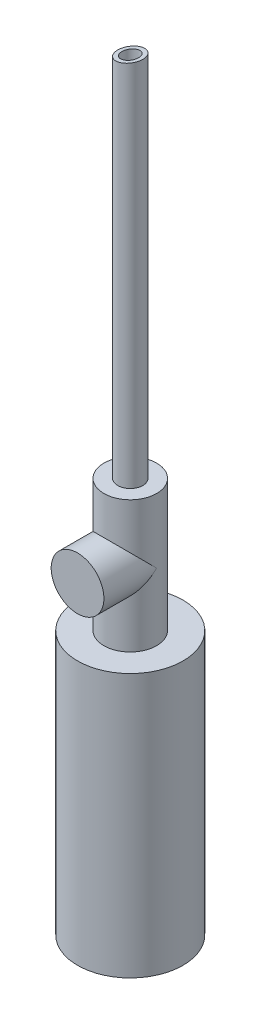
ISO-10303-21;
HEADER;
FILE_DESCRIPTION(('STEP AP214'),'2;1');
FILE_NAME('part.step','',(''),(''),'','','');
FILE_SCHEMA(('AUTOMOTIVE_DESIGN { 1 0 10303 214 1 1 1 1 }'));
ENDSEC;
DATA;
#1=APPLICATION_CONTEXT('core data for automotive mechanical design processes');
#2=APPLICATION_PROTOCOL_DEFINITION('international standard','automotive_design',2000,#1);
#3=PRODUCT_CONTEXT('',#1,'mechanical');
#4=PRODUCT('Part','Part','',(#3));
#5=PRODUCT_RELATED_PRODUCT_CATEGORY('part','',(#4));
#6=PRODUCT_DEFINITION_FORMATION('','',#4);
#7=PRODUCT_DEFINITION_CONTEXT('part definition',#1,'design');
#8=PRODUCT_DEFINITION('design','',#6,#7);
#9=PRODUCT_DEFINITION_SHAPE('','',#8);
#10=(LENGTH_UNIT() NAMED_UNIT(*) SI_UNIT(.MILLI.,.METRE.));
#11=(NAMED_UNIT(*) PLANE_ANGLE_UNIT() SI_UNIT($,.RADIAN.));
#12=(NAMED_UNIT(*) SI_UNIT($,.STERADIAN.) SOLID_ANGLE_UNIT());
#13=UNCERTAINTY_MEASURE_WITH_UNIT(LENGTH_MEASURE(1.E-05),#10,'distance_accuracy_value','');
#14=(GEOMETRIC_REPRESENTATION_CONTEXT(3) GLOBAL_UNCERTAINTY_ASSIGNED_CONTEXT((#13)) GLOBAL_UNIT_ASSIGNED_CONTEXT((#10,
#11,#12)) REPRESENTATION_CONTEXT('',''));
#15=CARTESIAN_POINT('',(0.,0.,0.));
#16=DIRECTION('',(0.,0.,1.));
#17=DIRECTION('',(1.,0.,0.));
#18=AXIS2_PLACEMENT_3D('',#15,#16,#17);
#19=CARTESIAN_POINT('',(0.,70.,0.));
#20=DIRECTION('',(0.,-1.,0.));
#21=DIRECTION('',(0.,0.,-1.));
#22=AXIS2_PLACEMENT_3D('',#19,#20,#21);
#23=CYLINDRICAL_SURFACE('',#22,1.5875);
#24=CARTESIAN_POINT('',(0.,69.5801037444899,0.));
#25=DIRECTION('',(0.173648177666924,-0.984807753012209,0.));
#26=DIRECTION('',(-0.984807753012209,-0.173648177666924,0.));
#27=AXIS2_PLACEMENT_3D('',#24,#25,#26);
#28=ELLIPSE('',#27,1.61198974636862,1.5875);
#29=CARTESIAN_POINT('',(-1.5875,69.3001846626152,0.));
#30=VERTEX_POINT('',#29);
#31=EDGE_CURVE('E71',#30,#30,#28,.T.);
#32=ORIENTED_EDGE('',*,*,#31,.F.);
#33=EDGE_LOOP('',(#32));
#34=FACE_BOUND('',#33,.T.);
#35=CARTESIAN_POINT('',(0.,-75.,0.));
#36=DIRECTION('',(0.,-1.,0.));
#37=DIRECTION('',(0.,0.,-1.));
#38=AXIS2_PLACEMENT_3D('',#35,#36,#37);
#39=CIRCLE('',#38,1.5875);
#40=CARTESIAN_POINT('',(0.,-75.,-1.5875));
#41=VERTEX_POINT('',#40);
#42=EDGE_CURVE('E89',#41,#41,#39,.T.);
#43=ORIENTED_EDGE('',*,*,#42,.T.);
#44=EDGE_LOOP('',(#43));
#45=FACE_BOUND('',#44,.T.);
#46=CARTESIAN_POINT('',(1.5875,-7.50870864109787,0.));
#47=CARTESIAN_POINT('',(1.58750104820739,-7.50871265561701,0.0434497351505559));
#48=CARTESIAN_POINT('',(1.58571503141911,-7.50811061657372,0.0868774357412352));
#49=CARTESIAN_POINT('',(1.57859869936247,-7.50573533559264,0.173398596213021));
#50=CARTESIAN_POINT('',(1.57326926210937,-7.50396238379312,0.216492136219529));
#51=CARTESIAN_POINT('',(1.5520605813723,-7.49696497284323,0.344558622898593));
#52=CARTESIAN_POINT('',(1.53096045831394,-7.49006136700238,0.428636374475192));
#53=CARTESIAN_POINT('',(1.4755824744406,-7.47260674168889,0.591816751440926));
#54=CARTESIAN_POINT('',(1.44131057940769,-7.46205737367897,0.670921610315492));
#55=CARTESIAN_POINT('',(1.36062577529459,-7.43850760864096,0.822322396719127));
#56=CARTESIAN_POINT('',(1.31420628892034,-7.42550588485693,0.894614606620394));
#57=CARTESIAN_POINT('',(1.20879811341783,-7.39800450130921,1.03284002180055));
#58=CARTESIAN_POINT('',(1.14945501409711,-7.3834702401481,1.09849602148355));
#59=CARTESIAN_POINT('',(1.02063858868875,-7.35483453018602,1.21911454883322));
#60=CARTESIAN_POINT('',(0.951163509672575,-7.34073315679079,1.27407522225832));
#61=CARTESIAN_POINT('',(0.802044933772508,-7.3141531925829,1.37297772308469));
#62=CARTESIAN_POINT('',(0.722201346706593,-7.3017203592851,1.41663123982847));
#63=CARTESIAN_POINT('',(0.555846339887928,-7.28028618836593,1.48977876460656));
#64=CARTESIAN_POINT('',(0.469336809556629,-7.27128388265211,1.51927676792689));
#65=CARTESIAN_POINT('',(0.295021376983897,-7.25797067685453,1.56234455468669));
#66=CARTESIAN_POINT('',(0.207344097661405,-7.25351974422566,1.57639085311518));
#67=CARTESIAN_POINT('',(0.0307700224850538,-7.24931557428355,1.58966768511353));
#68=CARTESIAN_POINT('',(-0.0581265078977142,-7.24956133007699,1.58890139426032));
#69=CARTESIAN_POINT('',(-0.2312541406687,-7.25462614202143,1.57288504722904));
#70=CARTESIAN_POINT('',(-0.315538618222665,-7.25928193904358,1.55815202184126));
#71=CARTESIAN_POINT('',(-0.480369177839427,-7.27244184180487,1.51547056077747));
#72=CARTESIAN_POINT('',(-0.560915056889398,-7.28094615625671,1.48752140836107));
#73=CARTESIAN_POINT('',(-0.717161971587112,-7.30106411739497,1.4188758936139));
#74=CARTESIAN_POINT('',(-0.792790018560453,-7.31271523553464,1.37802483439322));
#75=CARTESIAN_POINT('',(-0.936275883201467,-7.33790249382673,1.28486008788624));
#76=CARTESIAN_POINT('',(-1.00413175500067,-7.35143910416574,1.2325435395706));
#77=CARTESIAN_POINT('',(-1.13322329506337,-7.37964481211973,1.11529625834178));
#78=CARTESIAN_POINT('',(-1.19405054861288,-7.39433758161085,1.04992097091497));
#79=CARTESIAN_POINT('',(-1.30401384521535,-7.42270448723431,0.909747185706631));
#80=CARTESIAN_POINT('',(-1.35314631249426,-7.43637831094025,0.834945816490135));
#81=CARTESIAN_POINT('',(-1.43882863017655,-7.46128466091287,0.676841932445603));
#82=CARTESIAN_POINT('',(-1.47521520015295,-7.47248487276532,0.59344564872538));
#83=CARTESIAN_POINT('',(-1.53325512658078,-7.49079104381071,0.421311155507168));
#84=CARTESIAN_POINT('',(-1.55493135168499,-7.49790335539243,0.332581472170232));
#85=CARTESIAN_POINT('',(-1.57505764979512,-7.50455717400926,0.202501983179486));
#86=CARTESIAN_POINT('',(-1.57972231310535,-7.50611005678673,0.162130968977895));
#87=CARTESIAN_POINT('',(-1.58594106564123,-7.50818620640302,0.0811803188861637));
#88=CARTESIAN_POINT('',(-1.58749946588005,-7.50871090019219,0.0406010506006935));
#89=CARTESIAN_POINT('',(-1.5875,-7.50870864109787,0.));
#90=B_SPLINE_CURVE_WITH_KNOTS('',3,(#46,#47,#48,#49,#50,#51,#52,#53,#54,#55,#56,#57,#58,#59,#60,
#61,#62,#63,#64,#65,#66,#67,#68,#69,#70,#71,#72,#73,#74,#75,#76,#77,#78,#79,#80,#81,#82,#83,#84,
#85,#86,#87,#88,#89),.UNSPECIFIED.,.F.,.F.,(4,2,2,2,2,2,2,2,2,2,2,2,2,2,2,2,2,2,2,2,2,4),(0.,
0.130265270935833,0.260498275790315,0.520020177553924,0.779424674460253,1.03896991717402,
1.30681328763875,1.57470305264077,1.84886883664213,2.12295719385753,2.38833291253135,
2.65365173962154,2.90951723084376,3.16539659982045,3.42446859587644,3.68360531296129,
3.95384910768224,4.22417542575782,4.49784794036299,4.77109402396703,4.89299030095139,
5.01471728661815),.UNSPECIFIED.);
#91=CARTESIAN_POINT('',(1.5875,-7.50870864109787,0.));
#92=VERTEX_POINT('',#91);
#93=CARTESIAN_POINT('',(-1.5875,-7.50870864109787,0.));
#94=VERTEX_POINT('',#93);
#95=EDGE_CURVE('E94',#92,#94,#90,.T.);
#96=ORIENTED_EDGE('',*,*,#95,.T.);
#97=DIRECTION('',(0.,-1.,0.));
#98=VECTOR('',#97,1.);
#99=CARTESIAN_POINT('',(-1.5875,70.,0.));
#100=LINE('',#99,#98);
#101=CARTESIAN_POINT('',(-1.5875,-16.9912913589021,0.));
#102=VERTEX_POINT('',#101);
#103=EDGE_CURVE('E158',#94,#102,#100,.T.);
#104=ORIENTED_EDGE('',*,*,#103,.T.);
#105=CARTESIAN_POINT('',(-1.5875,-16.9912913589021,0.));
#106=CARTESIAN_POINT('',(-1.58750104820739,-16.991287344383,0.043449735150556));
#107=CARTESIAN_POINT('',(-1.58571503141911,-16.9918893834263,0.0868774357412354));
#108=CARTESIAN_POINT('',(-1.57859869936247,-16.9942646644074,0.173398596213022));
#109=CARTESIAN_POINT('',(-1.57326926210937,-16.9960376162069,0.21649213621953));
#110=CARTESIAN_POINT('',(-1.5520605813723,-17.0030350271568,0.344558622898593));
#111=CARTESIAN_POINT('',(-1.53096045831394,-17.0099386329976,0.428636374475192));
#112=CARTESIAN_POINT('',(-1.4755824744406,-17.0273932583111,0.591816751440927));
#113=CARTESIAN_POINT('',(-1.44131057940769,-17.037942626321,0.670921610315492));
#114=CARTESIAN_POINT('',(-1.36062577529459,-17.061492391359,0.822322396719127));
#115=CARTESIAN_POINT('',(-1.31420628892034,-17.0744941151431,0.894614606620395));
#116=CARTESIAN_POINT('',(-1.20879811341783,-17.1019954986908,1.03284002180055));
#117=CARTESIAN_POINT('',(-1.1494550140971,-17.1165297598519,1.09849602148355));
#118=CARTESIAN_POINT('',(-1.02063858868874,-17.145165469814,1.21911454883322));
#119=CARTESIAN_POINT('',(-0.951163509672574,-17.1592668432092,1.27407522225832));
#120=CARTESIAN_POINT('',(-0.802044933772507,-17.1858468074171,1.37297772308469));
#121=CARTESIAN_POINT('',(-0.722201346706591,-17.1982796407149,1.41663123982847));
#122=CARTESIAN_POINT('',(-0.555846339887926,-17.2197138116341,1.48977876460656));
#123=CARTESIAN_POINT('',(-0.469336809556627,-17.2287161173479,1.51927676792689));
#124=CARTESIAN_POINT('',(-0.295021376983895,-17.2420293231455,1.56234455468669));
#125=CARTESIAN_POINT('',(-0.207344097661404,-17.2464802557743,1.57639085311518));
#126=CARTESIAN_POINT('',(-0.0307700224850525,-17.2506844257165,1.58966768511353));
#127=CARTESIAN_POINT('',(0.0581265078977154,-17.250438669923,1.58890139426032));
#128=CARTESIAN_POINT('',(0.231254140668701,-17.2453738579786,1.57288504722904));
#129=CARTESIAN_POINT('',(0.315538618222666,-17.2407180609564,1.55815202184126));
#130=CARTESIAN_POINT('',(0.480369177839427,-17.2275581581951,1.51547056077747));
#131=CARTESIAN_POINT('',(0.560915056889399,-17.2190538437433,1.48752140836107));
#132=CARTESIAN_POINT('',(0.717161971587113,-17.198935882605,1.4188758936139));
#133=CARTESIAN_POINT('',(0.792790018560453,-17.1872847644654,1.37802483439322));
#134=CARTESIAN_POINT('',(0.936275883201468,-17.1620975061733,1.28486008788624));
#135=CARTESIAN_POINT('',(1.00413175500067,-17.1485608958343,1.2325435395706));
#136=CARTESIAN_POINT('',(1.13322329506337,-17.1203551878803,1.11529625834177));
#137=CARTESIAN_POINT('',(1.19405054861288,-17.1056624183892,1.04992097091497));
#138=CARTESIAN_POINT('',(1.30401384521535,-17.0772955127657,0.909747185706629));
#139=CARTESIAN_POINT('',(1.35314631249426,-17.0636216890598,0.834945816490133));
#140=CARTESIAN_POINT('',(1.43882863017655,-17.0387153390871,0.676841932445602));
#141=CARTESIAN_POINT('',(1.47521520015295,-17.0275151272347,0.593445648725378));
#142=CARTESIAN_POINT('',(1.53325512658078,-17.0092089561893,0.421311155507166));
#143=CARTESIAN_POINT('',(1.55493135168499,-17.0020966446076,0.332581472170231));
#144=CARTESIAN_POINT('',(1.57505764979512,-16.9954428259907,0.202501983179485));
#145=CARTESIAN_POINT('',(1.57972231310535,-16.9938899432133,0.162130968977894));
#146=CARTESIAN_POINT('',(1.58594106564123,-16.991813793597,0.0811803188861636));
#147=CARTESIAN_POINT('',(1.58749946588005,-16.9912890998078,0.0406010506006935));
#148=CARTESIAN_POINT('',(1.5875,-16.9912913589021,0.));
#149=B_SPLINE_CURVE_WITH_KNOTS('',3,(#105,#106,#107,#108,#109,#110,#111,#112,#113,#114,#115,
#116,#117,#118,#119,#120,#121,#122,#123,#124,#125,#126,#127,#128,#129,#130,#131,#132,#133,#134,
#135,#136,#137,#138,#139,#140,#141,#142,#143,#144,#145,#146,#147,#148),.UNSPECIFIED.,.F.,.F.,(4,
2,2,2,2,2,2,2,2,2,2,2,2,2,2,2,2,2,2,2,2,4),(0.,0.130265270935834,0.260498275790316,
0.520020177553924,0.779424674460253,1.03896991717402,1.30681328763875,1.57470305264077,
1.84886883664213,2.12295719385753,2.38833291253135,2.65365173962154,2.90951723084376,
3.16539659982045,3.42446859587644,3.6836053129613,3.95384910768224,4.22417542575782,
4.49784794036299,4.77109402396703,4.89299030095139,5.01471728661815),.UNSPECIFIED.);
#150=CARTESIAN_POINT('',(1.5875,-16.9912913589021,0.));
#151=VERTEX_POINT('',#150);
#152=EDGE_CURVE('E102',#102,#151,#149,.T.);
#153=ORIENTED_EDGE('',*,*,#152,.T.);
#154=DIRECTION('',(0.,-1.,0.));
#155=VECTOR('',#154,1.);
#156=CARTESIAN_POINT('',(1.5875,70.,0.));
#157=LINE('',#156,#155);
#158=EDGE_CURVE('E159',#151,#92,#157,.F.);
#159=ORIENTED_EDGE('',*,*,#158,.T.);
#160=EDGE_LOOP('',(#96,#104,#153,#159));
#161=FACE_BOUND('',#160,.T.);
#162=ADVANCED_FACE('F36',(#34,#45,#161),#23,.F.);
#163=CARTESIAN_POINT('',(0.,-25.,0.));
#164=DIRECTION('',(0.,1.,0.));
#165=DIRECTION('',(0.,0.,1.));
#166=AXIS2_PLACEMENT_3D('',#163,#164,#165);
#167=CYLINDRICAL_SURFACE('',#166,5.);
#168=CARTESIAN_POINT('',(0.,0.,0.));
#169=DIRECTION('',(0.,-1.,0.));
#170=DIRECTION('',(0.,0.,-1.));
#171=AXIS2_PLACEMENT_3D('',#168,#169,#170);
#172=CIRCLE('',#171,5.);
#173=CARTESIAN_POINT('',(0.,0.,-5.));
#174=VERTEX_POINT('',#173);
#175=EDGE_CURVE('E80',#174,#174,#172,.T.);
#176=ORIENTED_EDGE('',*,*,#175,.T.);
#177=EDGE_LOOP('',(#176));
#178=FACE_BOUND('',#177,.T.);
#179=CARTESIAN_POINT('',(0.,-25.,0.));
#180=DIRECTION('',(0.,-1.,0.));
#181=DIRECTION('',(0.,0.,-1.));
#182=AXIS2_PLACEMENT_3D('',#179,#180,#181);
#183=CIRCLE('',#182,5.);
#184=CARTESIAN_POINT('',(0.,-25.,-5.));
#185=VERTEX_POINT('',#184);
#186=EDGE_CURVE('E78',#185,#185,#183,.T.);
#187=ORIENTED_EDGE('',*,*,#186,.F.);
#188=EDGE_LOOP('',(#187));
#189=FACE_BOUND('',#188,.T.);
#190=CARTESIAN_POINT('',(0.,-12.25,0.));
#191=DIRECTION('',(0.,0.707106781186547,-0.707106781186547));
#192=DIRECTION('',(0.,0.707106781186547,0.707106781186547));
#193=AXIS2_PLACEMENT_3D('',#190,#191,#192);
#194=ELLIPSE('',#193,7.07106781186548,5.);
#195=CARTESIAN_POINT('',(5.,-12.25,0.));
#196=VERTEX_POINT('',#195);
#197=CARTESIAN_POINT('',(-5.,-12.25,0.));
#198=VERTEX_POINT('',#197);
#199=EDGE_CURVE('E11',#196,#198,#194,.F.);
#200=ORIENTED_EDGE('',*,*,#199,.F.);
#201=CARTESIAN_POINT('',(0.,-12.25,0.));
#202=DIRECTION('',(0.,0.707106781186547,0.707106781186547));
#203=DIRECTION('',(0.,0.707106781186547,-0.707106781186547));
#204=AXIS2_PLACEMENT_3D('',#201,#202,#203);
#205=ELLIPSE('',#204,7.07106781186548,5.);
#206=EDGE_CURVE('E44',#198,#196,#205,.T.);
#207=ORIENTED_EDGE('',*,*,#206,.F.);
#208=EDGE_LOOP('',(#200,#207));
#209=FACE_BOUND('',#208,.T.);
#210=ADVANCED_FACE('F66',(#178,#189,#209),#167,.T.);
#211=CARTESIAN_POINT('',(0.,70.,0.));
#212=DIRECTION('',(0.,-1.,0.));
#213=DIRECTION('',(0.,0.,-1.));
#214=AXIS2_PLACEMENT_3D('',#211,#212,#213);
#215=CYLINDRICAL_SURFACE('',#214,2.38135);
#216=CARTESIAN_POINT('',(0.,0.,0.));
#217=DIRECTION('',(0.,1.,0.));
#218=DIRECTION('',(0.,0.,1.));
#219=AXIS2_PLACEMENT_3D('',#216,#217,#218);
#220=CIRCLE('',#219,2.38135);
#221=CARTESIAN_POINT('',(0.,0.,2.38135));
#222=VERTEX_POINT('',#221);
#223=EDGE_CURVE('E76',#222,#222,#220,.T.);
#224=ORIENTED_EDGE('',*,*,#223,.T.);
#225=EDGE_LOOP('',(#224));
#226=FACE_BOUND('',#225,.T.);
#227=CARTESIAN_POINT('',(0.,69.5801037444899,0.));
#228=DIRECTION('',(0.173648177666924,-0.984807753012209,0.));
#229=DIRECTION('',(-0.984807753012209,-0.173648177666924,0.));
#230=AXIS2_PLACEMENT_3D('',#227,#228,#229);
#231=ELLIPSE('',#230,2.41808616221412,2.38135);
#232=CARTESIAN_POINT('',(-2.38135,69.1602074889798,0.));
#233=VERTEX_POINT('',#232);
#234=EDGE_CURVE('E69',#233,#233,#231,.T.);
#235=ORIENTED_EDGE('',*,*,#234,.T.);
#236=EDGE_LOOP('',(#235));
#237=FACE_BOUND('',#236,.T.);
#238=ADVANCED_FACE('F38',(#226,#237),#215,.T.);
#239=CARTESIAN_POINT('',(-2.38135,69.1602074889798,-2.38135));
#240=DIRECTION('',(0.173648177666924,-0.984807753012209,0.));
#241=DIRECTION('',(0.984807753012209,0.173648177666924,0.));
#242=AXIS2_PLACEMENT_3D('',#239,#240,#241);
#243=PLANE('',#242);
#244=ORIENTED_EDGE('',*,*,#31,.T.);
#245=EDGE_LOOP('',(#244));
#246=FACE_BOUND('',#245,.T.);
#247=ORIENTED_EDGE('',*,*,#234,.F.);
#248=EDGE_LOOP('',(#247));
#249=FACE_BOUND('',#248,.T.);
#250=ADVANCED_FACE('F136',(#246,#249),#243,.F.);
#251=CARTESIAN_POINT('',(0.,0.,0.));
#252=DIRECTION('',(0.,-1.,0.));
#253=DIRECTION('',(0.,0.,-1.));
#254=AXIS2_PLACEMENT_3D('',#251,#252,#253);
#255=PLANE('',#254);
#256=ORIENTED_EDGE('',*,*,#223,.F.);
#257=EDGE_LOOP('',(#256));
#258=FACE_BOUND('',#257,.T.);
#259=ORIENTED_EDGE('',*,*,#175,.F.);
#260=EDGE_LOOP('',(#259));
#261=FACE_BOUND('',#260,.T.);
#262=ADVANCED_FACE('F124',(#258,#261),#255,.F.);
#263=CARTESIAN_POINT('',(0.,-75.,0.));
#264=DIRECTION('',(0.,-1.,0.));
#265=DIRECTION('',(0.,0.,-1.));
#266=AXIS2_PLACEMENT_3D('',#263,#264,#265);
#267=PLANE('',#266);
#268=CARTESIAN_POINT('',(0.,-75.,0.));
#269=DIRECTION('',(0.,-1.,0.));
#270=DIRECTION('',(0.,0.,-1.));
#271=AXIS2_PLACEMENT_3D('',#268,#269,#270);
#272=CIRCLE('',#271,10.);
#273=CARTESIAN_POINT('',(0.,-75.,-10.));
#274=VERTEX_POINT('',#273);
#275=EDGE_CURVE('E83',#274,#274,#272,.T.);
#276=ORIENTED_EDGE('',*,*,#275,.T.);
#277=EDGE_LOOP('',(#276));
#278=FACE_BOUND('',#277,.T.);
#279=ORIENTED_EDGE('',*,*,#42,.F.);
#280=EDGE_LOOP('',(#279));
#281=FACE_BOUND('',#280,.T.);
#282=ADVANCED_FACE('F119',(#278,#281),#267,.T.);
#283=CARTESIAN_POINT('',(0.,-25.,0.));
#284=DIRECTION('',(0.,-1.,0.));
#285=DIRECTION('',(0.,0.,-1.));
#286=AXIS2_PLACEMENT_3D('',#283,#284,#285);
#287=PLANE('',#286);
#288=ORIENTED_EDGE('',*,*,#186,.T.);
#289=EDGE_LOOP('',(#288));
#290=FACE_BOUND('',#289,.T.);
#291=CARTESIAN_POINT('',(0.,-25.,0.));
#292=DIRECTION('',(0.,-1.,0.));
#293=DIRECTION('',(0.,0.,-1.));
#294=AXIS2_PLACEMENT_3D('',#291,#292,#293);
#295=CIRCLE('',#294,10.);
#296=CARTESIAN_POINT('',(0.,-25.,-10.));
#297=VERTEX_POINT('',#296);
#298=EDGE_CURVE('E86',#297,#297,#295,.T.);
#299=ORIENTED_EDGE('',*,*,#298,.F.);
#300=EDGE_LOOP('',(#299));
#301=FACE_BOUND('',#300,.T.);
#302=ADVANCED_FACE('F123',(#290,#301),#287,.F.);
#303=CARTESIAN_POINT('',(0.,-75.,0.));
#304=DIRECTION('',(0.,1.,0.));
#305=DIRECTION('',(0.,0.,1.));
#306=AXIS2_PLACEMENT_3D('',#303,#304,#305);
#307=CYLINDRICAL_SURFACE('',#306,10.);
#308=ORIENTED_EDGE('',*,*,#275,.F.);
#309=EDGE_LOOP('',(#308));
#310=FACE_BOUND('',#309,.T.);
#311=ORIENTED_EDGE('',*,*,#298,.T.);
#312=EDGE_LOOP('',(#311));
#313=FACE_BOUND('',#312,.T.);
#314=ADVANCED_FACE('F128',(#310,#313),#307,.T.);
#315=CARTESIAN_POINT('',(0.,-12.25,10.));
#316=DIRECTION('',(0.,0.,1.));
#317=DIRECTION('',(1.,0.,0.));
#318=AXIS2_PLACEMENT_3D('',#315,#316,#317);
#319=PLANE('',#318);
#320=CARTESIAN_POINT('',(0.,-12.25,10.));
#321=DIRECTION('',(0.,0.,1.));
#322=DIRECTION('',(1.,0.,0.));
#323=AXIS2_PLACEMENT_3D('',#320,#321,#322);
#324=CIRCLE('',#323,5.);
#325=CARTESIAN_POINT('',(5.,-12.25,10.));
#326=VERTEX_POINT('',#325);
#327=EDGE_CURVE('E161',#326,#326,#324,.T.);
#328=ORIENTED_EDGE('',*,*,#327,.T.);
#329=EDGE_LOOP('',(#328));
#330=FACE_BOUND('',#329,.T.);
#331=ADVANCED_FACE('F132',(#330),#319,.T.);
#332=CARTESIAN_POINT('',(0.,-12.25,10.));
#333=DIRECTION('',(0.,0.,-1.));
#334=DIRECTION('',(-1.,0.,0.));
#335=AXIS2_PLACEMENT_3D('',#332,#333,#334);
#336=CYLINDRICAL_SURFACE('',#335,5.);
#337=ORIENTED_EDGE('',*,*,#327,.F.);
#338=EDGE_LOOP('',(#337));
#339=FACE_BOUND('',#338,.T.);
#340=ORIENTED_EDGE('',*,*,#206,.T.);
#341=ORIENTED_EDGE('',*,*,#199,.T.);
#342=EDGE_LOOP('',(#340,#341));
#343=FACE_BOUND('',#342,.T.);
#344=ADVANCED_FACE('F68',(#339,#343),#336,.T.);
#345=ORIENTED_EDGE('',*,*,#95,.F.);
#346=CARTESIAN_POINT('',(0.,-12.25,0.));
#347=DIRECTION('',(0.,0.,1.));
#348=DIRECTION('',(1.,0.,0.));
#349=AXIS2_PLACEMENT_3D('',#346,#347,#348);
#350=CIRCLE('',#349,5.);
#351=EDGE_CURVE('E51',#92,#94,#350,.T.);
#352=ORIENTED_EDGE('',*,*,#351,.T.);
#353=EDGE_LOOP('',(#345,#352));
#354=FACE_BOUND('',#353,.T.);
#355=ADVANCED_FACE('F116',(#354),#336,.T.);
#356=ORIENTED_EDGE('',*,*,#152,.F.);
#357=EDGE_CURVE('E162',#102,#151,#350,.T.);
#358=ORIENTED_EDGE('',*,*,#357,.T.);
#359=EDGE_LOOP('',(#356,#358));
#360=FACE_BOUND('',#359,.T.);
#361=ADVANCED_FACE('F110',(#360),#336,.T.);
#362=CARTESIAN_POINT('',(0.,-12.25,0.));
#363=DIRECTION('',(0.,0.,1.));
#364=DIRECTION('',(1.,0.,0.));
#365=AXIS2_PLACEMENT_3D('',#362,#363,#364);
#366=PLANE('',#365);
#367=ORIENTED_EDGE('',*,*,#103,.F.);
#368=ORIENTED_EDGE('',*,*,#351,.F.);
#369=ORIENTED_EDGE('',*,*,#158,.F.);
#370=ORIENTED_EDGE('',*,*,#357,.F.);
#371=EDGE_LOOP('',(#367,#368,#369,#370));
#372=FACE_BOUND('',#371,.T.);
#373=ADVANCED_FACE('F115',(#372),#366,.F.);
#374=CLOSED_SHELL('',(#162,#210,#238,#250,#262,#282,#302,#314,#331,#344,#355,#361,#373));
#375=MANIFOLD_SOLID_BREP('B2',#374);
#376=ADVANCED_BREP_SHAPE_REPRESENTATION('',(#18,#375),#14);
#377=SHAPE_DEFINITION_REPRESENTATION(#9,#376);
ENDSEC;
END-ISO-10303-21;
